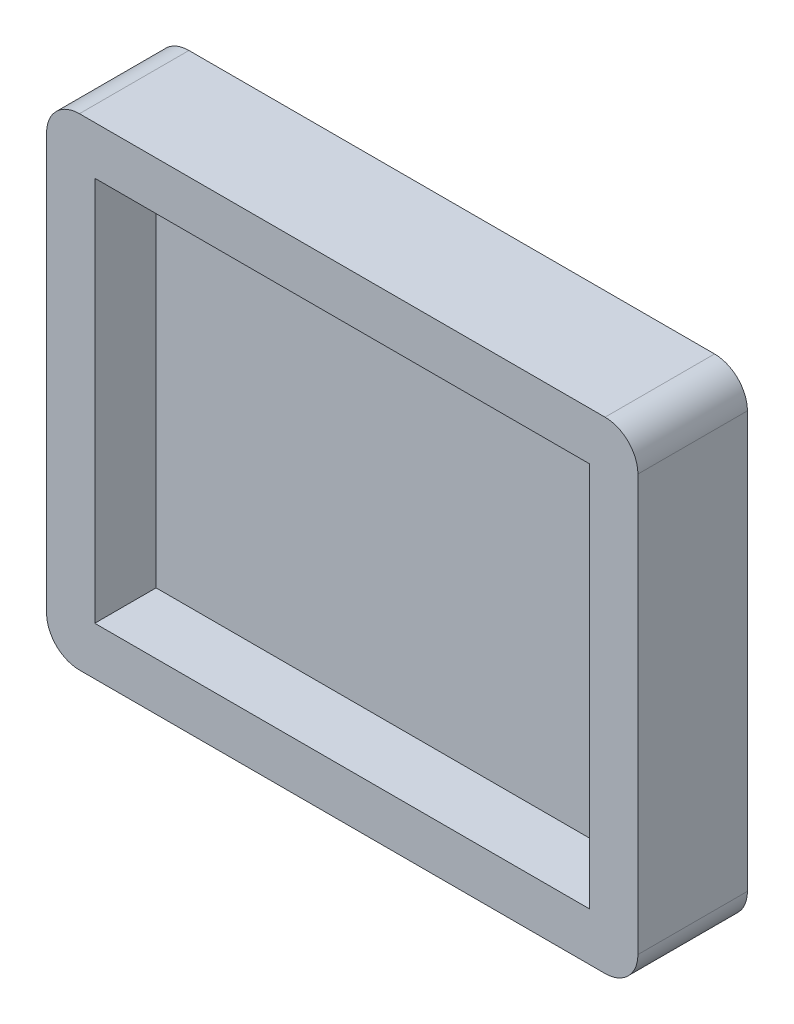
ISO-10303-21;
HEADER;
FILE_DESCRIPTION(('STEP AP214'),'2;1');
FILE_NAME('part.step','',(''),(''),'','','');
FILE_SCHEMA(('AUTOMOTIVE_DESIGN { 1 0 10303 214 1 1 1 1 }'));
ENDSEC;
DATA;
#1=APPLICATION_CONTEXT('core data for automotive mechanical design processes');
#2=APPLICATION_PROTOCOL_DEFINITION('international standard','automotive_design',2000,#1);
#3=PRODUCT_CONTEXT('',#1,'mechanical');
#4=PRODUCT('Part','Part','',(#3));
#5=PRODUCT_RELATED_PRODUCT_CATEGORY('part','',(#4));
#6=PRODUCT_DEFINITION_FORMATION('','',#4);
#7=PRODUCT_DEFINITION_CONTEXT('part definition',#1,'design');
#8=PRODUCT_DEFINITION('design','',#6,#7);
#9=PRODUCT_DEFINITION_SHAPE('','',#8);
#10=(LENGTH_UNIT() NAMED_UNIT(*) SI_UNIT(.MILLI.,.METRE.));
#11=(NAMED_UNIT(*) PLANE_ANGLE_UNIT() SI_UNIT($,.RADIAN.));
#12=(NAMED_UNIT(*) SI_UNIT($,.STERADIAN.) SOLID_ANGLE_UNIT());
#13=UNCERTAINTY_MEASURE_WITH_UNIT(LENGTH_MEASURE(1.E-05),#10,'distance_accuracy_value','');
#14=(GEOMETRIC_REPRESENTATION_CONTEXT(3) GLOBAL_UNCERTAINTY_ASSIGNED_CONTEXT((#13)) GLOBAL_UNIT_ASSIGNED_CONTEXT((#10,
#11,#12)) REPRESENTATION_CONTEXT('',''));
#15=CARTESIAN_POINT('',(0.,0.,0.));
#16=DIRECTION('',(0.,0.,1.));
#17=DIRECTION('',(1.,0.,0.));
#18=AXIS2_PLACEMENT_3D('',#15,#16,#17);
#19=CARTESIAN_POINT('',(0.,0.,0.));
#20=DIRECTION('',(0.,0.,1.));
#21=DIRECTION('',(1.,0.,0.));
#22=AXIS2_PLACEMENT_3D('',#19,#20,#21);
#23=PLANE('',#22);
#24=DIRECTION('',(0.,-1.,0.));
#25=VECTOR('',#24,1.);
#26=CARTESIAN_POINT('',(-11.3,11.,0.));
#27=LINE('',#26,#25);
#28=CARTESIAN_POINT('',(-11.3,8.8,0.));
#29=VERTEX_POINT('',#28);
#30=CARTESIAN_POINT('',(-11.3,-8.8,0.));
#31=VERTEX_POINT('',#30);
#32=EDGE_CURVE('E188',#29,#31,#27,.T.);
#33=ORIENTED_EDGE('',*,*,#32,.F.);
#34=DIRECTION('',(-1.,0.,0.));
#35=VECTOR('',#34,1.);
#36=CARTESIAN_POINT('',(13.5,8.8,0.));
#37=LINE('',#36,#35);
#38=CARTESIAN_POINT('',(11.3,8.8,0.));
#39=VERTEX_POINT('',#38);
#40=EDGE_CURVE('E176',#39,#29,#37,.T.);
#41=ORIENTED_EDGE('',*,*,#40,.F.);
#42=DIRECTION('',(0.,1.,0.));
#43=VECTOR('',#42,1.);
#44=CARTESIAN_POINT('',(11.3,11.,0.));
#45=LINE('',#44,#43);
#46=CARTESIAN_POINT('',(11.3,-8.8,0.));
#47=VERTEX_POINT('',#46);
#48=EDGE_CURVE('E194',#47,#39,#45,.T.);
#49=ORIENTED_EDGE('',*,*,#48,.F.);
#50=DIRECTION('',(1.,0.,0.));
#51=VECTOR('',#50,1.);
#52=CARTESIAN_POINT('',(13.5,-8.8,0.));
#53=LINE('',#52,#51);
#54=EDGE_CURVE('E191',#31,#47,#53,.T.);
#55=ORIENTED_EDGE('',*,*,#54,.F.);
#56=EDGE_LOOP('',(#33,#41,#49,#55));
#57=FACE_BOUND('',#56,.T.);
#58=CARTESIAN_POINT('',(12.,9.5,0.));
#59=DIRECTION('',(0.,0.,1.));
#60=DIRECTION('',(1.,0.,0.));
#61=AXIS2_PLACEMENT_3D('',#58,#59,#60);
#62=CIRCLE('',#61,1.5);
#63=CARTESIAN_POINT('',(12.,11.,0.));
#64=VERTEX_POINT('',#63);
#65=CARTESIAN_POINT('',(13.5,9.5,0.));
#66=VERTEX_POINT('',#65);
#67=EDGE_CURVE('E134',#64,#66,#62,.F.);
#68=ORIENTED_EDGE('',*,*,#67,.F.);
#69=DIRECTION('',(-1.,0.,0.));
#70=VECTOR('',#69,1.);
#71=CARTESIAN_POINT('',(13.5,11.,0.));
#72=LINE('',#71,#70);
#73=CARTESIAN_POINT('',(-12.,11.,0.));
#74=VERTEX_POINT('',#73);
#75=EDGE_CURVE('E130',#64,#74,#72,.T.);
#76=ORIENTED_EDGE('',*,*,#75,.T.);
#77=CARTESIAN_POINT('',(-12.,9.5,0.));
#78=DIRECTION('',(0.,0.,1.));
#79=DIRECTION('',(1.,0.,0.));
#80=AXIS2_PLACEMENT_3D('',#77,#78,#79);
#81=CIRCLE('',#80,1.5);
#82=CARTESIAN_POINT('',(-13.5,9.5,0.));
#83=VERTEX_POINT('',#82);
#84=EDGE_CURVE('E126',#83,#74,#81,.F.);
#85=ORIENTED_EDGE('',*,*,#84,.F.);
#86=DIRECTION('',(0.,-1.,0.));
#87=VECTOR('',#86,1.);
#88=CARTESIAN_POINT('',(-13.5,11.,0.));
#89=LINE('',#88,#87);
#90=CARTESIAN_POINT('',(-13.5,-9.5,0.));
#91=VERTEX_POINT('',#90);
#92=EDGE_CURVE('E127',#83,#91,#89,.T.);
#93=ORIENTED_EDGE('',*,*,#92,.T.);
#94=CARTESIAN_POINT('',(-12.,-9.5,0.));
#95=DIRECTION('',(0.,0.,1.));
#96=DIRECTION('',(1.,0.,0.));
#97=AXIS2_PLACEMENT_3D('',#94,#95,#96);
#98=CIRCLE('',#97,1.5);
#99=CARTESIAN_POINT('',(-12.,-11.,0.));
#100=VERTEX_POINT('',#99);
#101=EDGE_CURVE('E186',#100,#91,#98,.F.);
#102=ORIENTED_EDGE('',*,*,#101,.F.);
#103=DIRECTION('',(1.,0.,0.));
#104=VECTOR('',#103,1.);
#105=CARTESIAN_POINT('',(13.5,-11.,0.));
#106=LINE('',#105,#104);
#107=CARTESIAN_POINT('',(12.,-11.,0.));
#108=VERTEX_POINT('',#107);
#109=EDGE_CURVE('E138',#100,#108,#106,.T.);
#110=ORIENTED_EDGE('',*,*,#109,.T.);
#111=CARTESIAN_POINT('',(12.,-9.5,0.));
#112=DIRECTION('',(0.,0.,1.));
#113=DIRECTION('',(1.,0.,0.));
#114=AXIS2_PLACEMENT_3D('',#111,#112,#113);
#115=CIRCLE('',#114,1.5);
#116=CARTESIAN_POINT('',(13.5,-9.5,0.));
#117=VERTEX_POINT('',#116);
#118=EDGE_CURVE('E184',#117,#108,#115,.F.);
#119=ORIENTED_EDGE('',*,*,#118,.F.);
#120=DIRECTION('',(0.,1.,0.));
#121=VECTOR('',#120,1.);
#122=CARTESIAN_POINT('',(13.5,11.,0.));
#123=LINE('',#122,#121);
#124=EDGE_CURVE('E178',#117,#66,#123,.T.);
#125=ORIENTED_EDGE('',*,*,#124,.T.);
#126=EDGE_LOOP('',(#68,#76,#85,#93,#102,#110,#119,#125));
#127=FACE_BOUND('',#126,.T.);
#128=ADVANCED_FACE('F33',(#57,#127),#23,.T.);
#129=CARTESIAN_POINT('',(13.5,-8.8,5.));
#130=DIRECTION('',(0.,1.,0.));
#131=DIRECTION('',(-1.,0.,0.));
#132=AXIS2_PLACEMENT_3D('',#129,#130,#131);
#133=PLANE('',#132);
#134=DIRECTION('',(0.,0.,1.));
#135=VECTOR('',#134,1.);
#136=CARTESIAN_POINT('',(-11.3,-8.8,5.));
#137=LINE('',#136,#135);
#138=CARTESIAN_POINT('',(-11.3,-8.8,-2.8));
#139=VERTEX_POINT('',#138);
#140=EDGE_CURVE('E161',#139,#31,#137,.T.);
#141=ORIENTED_EDGE('',*,*,#140,.T.);
#142=ORIENTED_EDGE('',*,*,#54,.T.);
#143=DIRECTION('',(0.,0.,1.));
#144=VECTOR('',#143,1.);
#145=CARTESIAN_POINT('',(11.3,-8.8,5.));
#146=LINE('',#145,#144);
#147=CARTESIAN_POINT('',(11.3,-8.8,-2.8));
#148=VERTEX_POINT('',#147);
#149=EDGE_CURVE('E165',#148,#47,#146,.T.);
#150=ORIENTED_EDGE('',*,*,#149,.F.);
#151=DIRECTION('',(1.,0.,0.));
#152=VECTOR('',#151,1.);
#153=CARTESIAN_POINT('',(0.,-8.8,-2.8));
#154=LINE('',#153,#152);
#155=EDGE_CURVE('E164',#139,#148,#154,.T.);
#156=ORIENTED_EDGE('',*,*,#155,.F.);
#157=EDGE_LOOP('',(#141,#142,#150,#156));
#158=FACE_BOUND('',#157,.T.);
#159=ADVANCED_FACE('F224',(#158),#133,.T.);
#160=CARTESIAN_POINT('',(0.,0.,-2.8));
#161=DIRECTION('',(0.,0.,-1.));
#162=DIRECTION('',(-1.,0.,0.));
#163=AXIS2_PLACEMENT_3D('',#160,#161,#162);
#164=PLANE('',#163);
#165=DIRECTION('',(0.,-1.,0.));
#166=VECTOR('',#165,1.);
#167=CARTESIAN_POINT('',(-11.3,0.,-2.8));
#168=LINE('',#167,#166);
#169=CARTESIAN_POINT('',(-11.3,8.8,-2.8));
#170=VERTEX_POINT('',#169);
#171=EDGE_CURVE('E160',#170,#139,#168,.T.);
#172=ORIENTED_EDGE('',*,*,#171,.T.);
#173=ORIENTED_EDGE('',*,*,#155,.T.);
#174=DIRECTION('',(0.,1.,0.));
#175=VECTOR('',#174,1.);
#176=CARTESIAN_POINT('',(11.3,0.,-2.8));
#177=LINE('',#176,#175);
#178=CARTESIAN_POINT('',(11.3,8.8,-2.8));
#179=VERTEX_POINT('',#178);
#180=EDGE_CURVE('E168',#148,#179,#177,.T.);
#181=ORIENTED_EDGE('',*,*,#180,.T.);
#182=DIRECTION('',(-1.,0.,0.));
#183=VECTOR('',#182,1.);
#184=CARTESIAN_POINT('',(0.,8.8,-2.8));
#185=LINE('',#184,#183);
#186=EDGE_CURVE('E172',#179,#170,#185,.T.);
#187=ORIENTED_EDGE('',*,*,#186,.T.);
#188=EDGE_LOOP('',(#172,#173,#181,#187));
#189=FACE_BOUND('',#188,.T.);
#190=ADVANCED_FACE('F215',(#189),#164,.F.);
#191=CARTESIAN_POINT('',(-11.3,11.,5.));
#192=DIRECTION('',(1.,0.,0.));
#193=DIRECTION('',(0.,1.,0.));
#194=AXIS2_PLACEMENT_3D('',#191,#192,#193);
#195=PLANE('',#194);
#196=DIRECTION('',(0.,0.,1.));
#197=VECTOR('',#196,1.);
#198=CARTESIAN_POINT('',(-11.3,8.8,5.));
#199=LINE('',#198,#197);
#200=EDGE_CURVE('E173',#170,#29,#199,.T.);
#201=ORIENTED_EDGE('',*,*,#200,.T.);
#202=ORIENTED_EDGE('',*,*,#32,.T.);
#203=ORIENTED_EDGE('',*,*,#140,.F.);
#204=ORIENTED_EDGE('',*,*,#171,.F.);
#205=EDGE_LOOP('',(#201,#202,#203,#204));
#206=FACE_BOUND('',#205,.T.);
#207=ADVANCED_FACE('F221',(#206),#195,.T.);
#208=CARTESIAN_POINT('',(11.3,11.,5.));
#209=DIRECTION('',(-1.,0.,0.));
#210=DIRECTION('',(0.,-1.,0.));
#211=AXIS2_PLACEMENT_3D('',#208,#209,#210);
#212=PLANE('',#211);
#213=ORIENTED_EDGE('',*,*,#149,.T.);
#214=ORIENTED_EDGE('',*,*,#48,.T.);
#215=DIRECTION('',(0.,0.,1.));
#216=VECTOR('',#215,1.);
#217=CARTESIAN_POINT('',(11.3,8.8,5.));
#218=LINE('',#217,#216);
#219=EDGE_CURVE('E169',#179,#39,#218,.T.);
#220=ORIENTED_EDGE('',*,*,#219,.F.);
#221=ORIENTED_EDGE('',*,*,#180,.F.);
#222=EDGE_LOOP('',(#213,#214,#220,#221));
#223=FACE_BOUND('',#222,.T.);
#224=ADVANCED_FACE('F228',(#223),#212,.T.);
#225=CARTESIAN_POINT('',(13.5,8.8,5.));
#226=DIRECTION('',(0.,-1.,0.));
#227=DIRECTION('',(1.,0.,0.));
#228=AXIS2_PLACEMENT_3D('',#225,#226,#227);
#229=PLANE('',#228);
#230=ORIENTED_EDGE('',*,*,#219,.T.);
#231=ORIENTED_EDGE('',*,*,#40,.T.);
#232=ORIENTED_EDGE('',*,*,#200,.F.);
#233=ORIENTED_EDGE('',*,*,#186,.F.);
#234=EDGE_LOOP('',(#230,#231,#232,#233));
#235=FACE_BOUND('',#234,.T.);
#236=ADVANCED_FACE('F230',(#235),#229,.T.);
#237=CARTESIAN_POINT('',(0.,0.,-5.));
#238=DIRECTION('',(0.,0.,-1.));
#239=DIRECTION('',(-1.,0.,0.));
#240=AXIS2_PLACEMENT_3D('',#237,#238,#239);
#241=PLANE('',#240);
#242=DIRECTION('',(0.,-1.,0.));
#243=VECTOR('',#242,1.);
#244=CARTESIAN_POINT('',(-13.5,11.,-5.));
#245=LINE('',#244,#243);
#246=CARTESIAN_POINT('',(-13.5,9.5,-5.));
#247=VERTEX_POINT('',#246);
#248=CARTESIAN_POINT('',(-13.5,-9.5,-5.));
#249=VERTEX_POINT('',#248);
#250=EDGE_CURVE('E11',#247,#249,#245,.T.);
#251=ORIENTED_EDGE('',*,*,#250,.F.);
#252=CARTESIAN_POINT('',(-12.,9.5,-5.));
#253=DIRECTION('',(0.,0.,-1.));
#254=DIRECTION('',(-1.,0.,0.));
#255=AXIS2_PLACEMENT_3D('',#252,#253,#254);
#256=CIRCLE('',#255,1.5);
#257=CARTESIAN_POINT('',(-12.,11.,-5.));
#258=VERTEX_POINT('',#257);
#259=EDGE_CURVE('E141',#247,#258,#256,.T.);
#260=ORIENTED_EDGE('',*,*,#259,.T.);
#261=DIRECTION('',(-1.,0.,0.));
#262=VECTOR('',#261,1.);
#263=CARTESIAN_POINT('',(13.5,11.,-5.));
#264=LINE('',#263,#262);
#265=CARTESIAN_POINT('',(12.,11.,-5.));
#266=VERTEX_POINT('',#265);
#267=EDGE_CURVE('E142',#266,#258,#264,.T.);
#268=ORIENTED_EDGE('',*,*,#267,.F.);
#269=CARTESIAN_POINT('',(12.,9.5,-5.));
#270=DIRECTION('',(0.,0.,-1.));
#271=DIRECTION('',(-1.,0.,0.));
#272=AXIS2_PLACEMENT_3D('',#269,#270,#271);
#273=CIRCLE('',#272,1.5);
#274=CARTESIAN_POINT('',(13.5,9.5,-5.));
#275=VERTEX_POINT('',#274);
#276=EDGE_CURVE('E206',#266,#275,#273,.T.);
#277=ORIENTED_EDGE('',*,*,#276,.T.);
#278=DIRECTION('',(0.,1.,0.));
#279=VECTOR('',#278,1.);
#280=CARTESIAN_POINT('',(13.5,11.,-5.));
#281=LINE('',#280,#279);
#282=CARTESIAN_POINT('',(13.5,-9.5,-5.));
#283=VERTEX_POINT('',#282);
#284=EDGE_CURVE('E200',#283,#275,#281,.T.);
#285=ORIENTED_EDGE('',*,*,#284,.F.);
#286=CARTESIAN_POINT('',(12.,-9.5,-5.));
#287=DIRECTION('',(0.,0.,-1.));
#288=DIRECTION('',(-1.,0.,0.));
#289=AXIS2_PLACEMENT_3D('',#286,#287,#288);
#290=CIRCLE('',#289,1.5);
#291=CARTESIAN_POINT('',(12.,-11.,-5.));
#292=VERTEX_POINT('',#291);
#293=EDGE_CURVE('E143',#283,#292,#290,.T.);
#294=ORIENTED_EDGE('',*,*,#293,.T.);
#295=DIRECTION('',(1.,0.,0.));
#296=VECTOR('',#295,1.);
#297=CARTESIAN_POINT('',(13.5,-11.,-5.));
#298=LINE('',#297,#296);
#299=CARTESIAN_POINT('',(-12.,-11.,-5.));
#300=VERTEX_POINT('',#299);
#301=EDGE_CURVE('E42',#300,#292,#298,.T.);
#302=ORIENTED_EDGE('',*,*,#301,.F.);
#303=CARTESIAN_POINT('',(-12.,-9.5,-5.));
#304=DIRECTION('',(0.,0.,-1.));
#305=DIRECTION('',(-1.,0.,0.));
#306=AXIS2_PLACEMENT_3D('',#303,#304,#305);
#307=CIRCLE('',#306,1.5);
#308=EDGE_CURVE('E57',#300,#249,#307,.T.);
#309=ORIENTED_EDGE('',*,*,#308,.T.);
#310=EDGE_LOOP('',(#251,#260,#268,#277,#285,#294,#302,#309));
#311=FACE_BOUND('',#310,.T.);
#312=ADVANCED_FACE('F271',(#311),#241,.T.);
#313=CARTESIAN_POINT('',(-13.5,11.,5.));
#314=DIRECTION('',(1.,0.,0.));
#315=DIRECTION('',(0.,1.,0.));
#316=AXIS2_PLACEMENT_3D('',#313,#314,#315);
#317=PLANE('',#316);
#318=ORIENTED_EDGE('',*,*,#92,.F.);
#319=DIRECTION('',(0.,0.,-1.));
#320=VECTOR('',#319,1.);
#321=CARTESIAN_POINT('',(-13.5,9.5,5.));
#322=LINE('',#321,#320);
#323=EDGE_CURVE('E49',#83,#247,#322,.T.);
#324=ORIENTED_EDGE('',*,*,#323,.T.);
#325=ORIENTED_EDGE('',*,*,#250,.T.);
#326=DIRECTION('',(0.,0.,-1.));
#327=VECTOR('',#326,1.);
#328=CARTESIAN_POINT('',(-13.5,-9.5,5.));
#329=LINE('',#328,#327);
#330=EDGE_CURVE('E37',#249,#91,#329,.F.);
#331=ORIENTED_EDGE('',*,*,#330,.T.);
#332=EDGE_LOOP('',(#318,#324,#325,#331));
#333=FACE_BOUND('',#332,.T.);
#334=ADVANCED_FACE('F136',(#333),#317,.F.);
#335=CARTESIAN_POINT('',(13.5,-11.,5.));
#336=DIRECTION('',(0.,1.,0.));
#337=DIRECTION('',(-1.,0.,0.));
#338=AXIS2_PLACEMENT_3D('',#335,#336,#337);
#339=PLANE('',#338);
#340=ORIENTED_EDGE('',*,*,#109,.F.);
#341=DIRECTION('',(0.,0.,-1.));
#342=VECTOR('',#341,1.);
#343=CARTESIAN_POINT('',(-12.,-11.,5.));
#344=LINE('',#343,#342);
#345=EDGE_CURVE('E155',#100,#300,#344,.T.);
#346=ORIENTED_EDGE('',*,*,#345,.T.);
#347=ORIENTED_EDGE('',*,*,#301,.T.);
#348=DIRECTION('',(0.,0.,-1.));
#349=VECTOR('',#348,1.);
#350=CARTESIAN_POINT('',(12.,-11.,5.));
#351=LINE('',#350,#349);
#352=EDGE_CURVE('E157',#292,#108,#351,.F.);
#353=ORIENTED_EDGE('',*,*,#352,.T.);
#354=EDGE_LOOP('',(#340,#346,#347,#353));
#355=FACE_BOUND('',#354,.T.);
#356=ADVANCED_FACE('F270',(#355),#339,.F.);
#357=CARTESIAN_POINT('',(-12.,-9.5,5.));
#358=DIRECTION('',(0.,0.,-1.));
#359=DIRECTION('',(-1.,0.,0.));
#360=AXIS2_PLACEMENT_3D('',#357,#358,#359);
#361=CYLINDRICAL_SURFACE('',#360,1.5);
#362=ORIENTED_EDGE('',*,*,#345,.F.);
#363=ORIENTED_EDGE('',*,*,#101,.T.);
#364=ORIENTED_EDGE('',*,*,#330,.F.);
#365=ORIENTED_EDGE('',*,*,#308,.F.);
#366=EDGE_LOOP('',(#362,#363,#364,#365));
#367=FACE_BOUND('',#366,.T.);
#368=ADVANCED_FACE('F35',(#367),#361,.T.);
#369=CARTESIAN_POINT('',(13.5,11.,5.));
#370=DIRECTION('',(-1.,0.,0.));
#371=DIRECTION('',(0.,-1.,0.));
#372=AXIS2_PLACEMENT_3D('',#369,#370,#371);
#373=PLANE('',#372);
#374=ORIENTED_EDGE('',*,*,#124,.F.);
#375=DIRECTION('',(0.,0.,-1.));
#376=VECTOR('',#375,1.);
#377=CARTESIAN_POINT('',(13.5,-9.5,5.));
#378=LINE('',#377,#376);
#379=EDGE_CURVE('E150',#117,#283,#378,.T.);
#380=ORIENTED_EDGE('',*,*,#379,.T.);
#381=ORIENTED_EDGE('',*,*,#284,.T.);
#382=DIRECTION('',(0.,0.,-1.));
#383=VECTOR('',#382,1.);
#384=CARTESIAN_POINT('',(13.5,9.5,5.));
#385=LINE('',#384,#383);
#386=EDGE_CURVE('E152',#275,#66,#385,.F.);
#387=ORIENTED_EDGE('',*,*,#386,.T.);
#388=EDGE_LOOP('',(#374,#380,#381,#387));
#389=FACE_BOUND('',#388,.T.);
#390=ADVANCED_FACE('F253',(#389),#373,.F.);
#391=CARTESIAN_POINT('',(12.,-9.5,5.));
#392=DIRECTION('',(0.,0.,-1.));
#393=DIRECTION('',(-1.,0.,0.));
#394=AXIS2_PLACEMENT_3D('',#391,#392,#393);
#395=CYLINDRICAL_SURFACE('',#394,1.5);
#396=ORIENTED_EDGE('',*,*,#379,.F.);
#397=ORIENTED_EDGE('',*,*,#118,.T.);
#398=ORIENTED_EDGE('',*,*,#352,.F.);
#399=ORIENTED_EDGE('',*,*,#293,.F.);
#400=EDGE_LOOP('',(#396,#397,#398,#399));
#401=FACE_BOUND('',#400,.T.);
#402=ADVANCED_FACE('F251',(#401),#395,.T.);
#403=CARTESIAN_POINT('',(13.5,11.,5.));
#404=DIRECTION('',(0.,-1.,0.));
#405=DIRECTION('',(1.,0.,0.));
#406=AXIS2_PLACEMENT_3D('',#403,#404,#405);
#407=PLANE('',#406);
#408=ORIENTED_EDGE('',*,*,#75,.F.);
#409=DIRECTION('',(0.,0.,-1.));
#410=VECTOR('',#409,1.);
#411=CARTESIAN_POINT('',(12.,11.,5.));
#412=LINE('',#411,#410);
#413=EDGE_CURVE('E146',#64,#266,#412,.T.);
#414=ORIENTED_EDGE('',*,*,#413,.T.);
#415=ORIENTED_EDGE('',*,*,#267,.T.);
#416=DIRECTION('',(0.,0.,-1.));
#417=VECTOR('',#416,1.);
#418=CARTESIAN_POINT('',(-12.,11.,5.));
#419=LINE('',#418,#417);
#420=EDGE_CURVE('E148',#258,#74,#419,.F.);
#421=ORIENTED_EDGE('',*,*,#420,.T.);
#422=EDGE_LOOP('',(#408,#414,#415,#421));
#423=FACE_BOUND('',#422,.T.);
#424=ADVANCED_FACE('F246',(#423),#407,.F.);
#425=CARTESIAN_POINT('',(12.,9.5,5.));
#426=DIRECTION('',(0.,0.,-1.));
#427=DIRECTION('',(-1.,0.,0.));
#428=AXIS2_PLACEMENT_3D('',#425,#426,#427);
#429=CYLINDRICAL_SURFACE('',#428,1.5);
#430=ORIENTED_EDGE('',*,*,#413,.F.);
#431=ORIENTED_EDGE('',*,*,#67,.T.);
#432=ORIENTED_EDGE('',*,*,#386,.F.);
#433=ORIENTED_EDGE('',*,*,#276,.F.);
#434=EDGE_LOOP('',(#430,#431,#432,#433));
#435=FACE_BOUND('',#434,.T.);
#436=ADVANCED_FACE('F241',(#435),#429,.T.);
#437=CARTESIAN_POINT('',(-12.,9.5,5.));
#438=DIRECTION('',(0.,0.,-1.));
#439=DIRECTION('',(-1.,0.,0.));
#440=AXIS2_PLACEMENT_3D('',#437,#438,#439);
#441=CYLINDRICAL_SURFACE('',#440,1.5);
#442=ORIENTED_EDGE('',*,*,#323,.F.);
#443=ORIENTED_EDGE('',*,*,#84,.T.);
#444=ORIENTED_EDGE('',*,*,#420,.F.);
#445=ORIENTED_EDGE('',*,*,#259,.F.);
#446=EDGE_LOOP('',(#442,#443,#444,#445));
#447=FACE_BOUND('',#446,.T.);
#448=ADVANCED_FACE('F140',(#447),#441,.T.);
#449=CLOSED_SHELL('',(#128,#159,#190,#207,#224,#236,#312,#334,#356,#368,#390,#402,#424,#436,#448));
#450=MANIFOLD_SOLID_BREP('B2',#449);
#451=ADVANCED_BREP_SHAPE_REPRESENTATION('',(#18,#450),#14);
#452=SHAPE_DEFINITION_REPRESENTATION(#9,#451);
ENDSEC;
END-ISO-10303-21;
